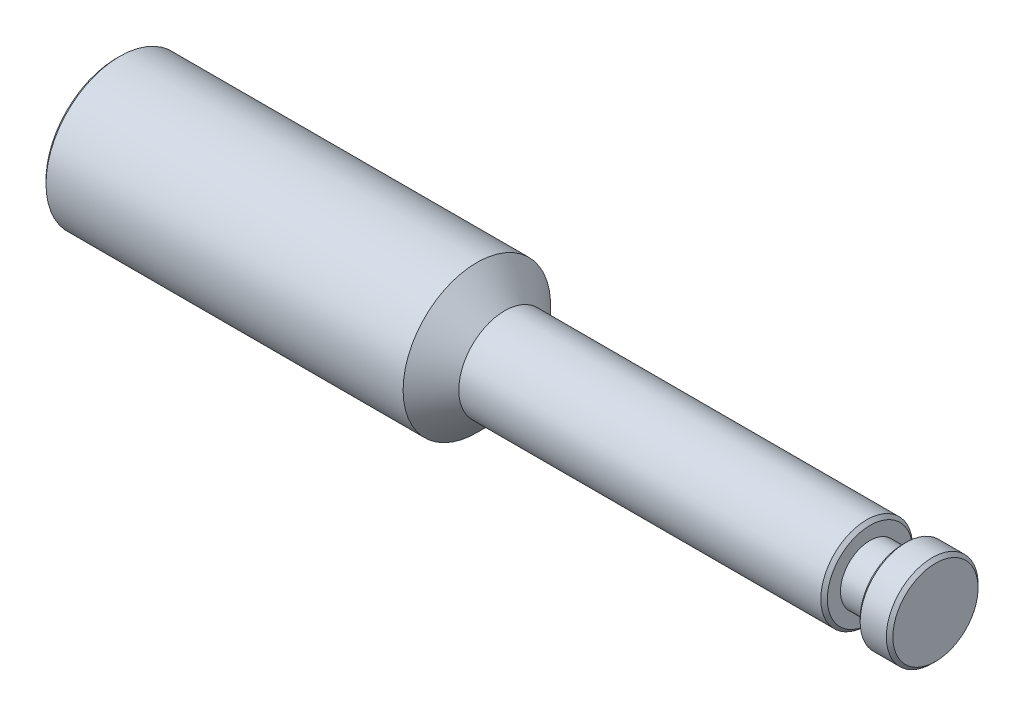
ISO-10303-21;
HEADER;
FILE_DESCRIPTION(('STEP AP214'),'2;1');
FILE_NAME('part.step','',(''),(''),'','','');
FILE_SCHEMA(('AUTOMOTIVE_DESIGN { 1 0 10303 214 1 1 1 1 }'));
ENDSEC;
DATA;
#1=APPLICATION_CONTEXT('core data for automotive mechanical design processes');
#2=APPLICATION_PROTOCOL_DEFINITION('international standard','automotive_design',2000,#1);
#3=PRODUCT_CONTEXT('',#1,'mechanical');
#4=PRODUCT('Part','Part','',(#3));
#5=PRODUCT_RELATED_PRODUCT_CATEGORY('part','',(#4));
#6=PRODUCT_DEFINITION_FORMATION('','',#4);
#7=PRODUCT_DEFINITION_CONTEXT('part definition',#1,'design');
#8=PRODUCT_DEFINITION('design','',#6,#7);
#9=PRODUCT_DEFINITION_SHAPE('','',#8);
#10=(LENGTH_UNIT() NAMED_UNIT(*) SI_UNIT(.MILLI.,.METRE.));
#11=(NAMED_UNIT(*) PLANE_ANGLE_UNIT() SI_UNIT($,.RADIAN.));
#12=(NAMED_UNIT(*) SI_UNIT($,.STERADIAN.) SOLID_ANGLE_UNIT());
#13=UNCERTAINTY_MEASURE_WITH_UNIT(LENGTH_MEASURE(1.E-05),#10,'distance_accuracy_value','');
#14=(GEOMETRIC_REPRESENTATION_CONTEXT(3) GLOBAL_UNCERTAINTY_ASSIGNED_CONTEXT((#13)) GLOBAL_UNIT_ASSIGNED_CONTEXT((#10,
#11,#12)) REPRESENTATION_CONTEXT('',''));
#15=CARTESIAN_POINT('',(0.,0.,0.));
#16=DIRECTION('',(0.,0.,1.));
#17=DIRECTION('',(1.,0.,0.));
#18=AXIS2_PLACEMENT_3D('',#15,#16,#17);
#19=CARTESIAN_POINT('',(0.,0.,0.));
#20=DIRECTION('',(-1.,0.,0.));
#21=DIRECTION('',(0.,0.,1.));
#22=AXIS2_PLACEMENT_3D('',#19,#20,#21);
#23=CYLINDRICAL_SURFACE('',#22,14.);
#24=CARTESIAN_POINT('',(229.,0.,0.));
#25=DIRECTION('',(1.,0.,0.));
#26=DIRECTION('',(0.,0.,-1.));
#27=AXIS2_PLACEMENT_3D('',#24,#25,#26);
#28=CIRCLE('',#27,14.);
#29=CARTESIAN_POINT('',(229.,0.,-14.));
#30=VERTEX_POINT('',#29);
#31=EDGE_CURVE('E52',#30,#30,#28,.F.);
#32=ORIENTED_EDGE('',*,*,#31,.T.);
#33=EDGE_LOOP('',(#32));
#34=FACE_BOUND('',#33,.T.);
#35=CARTESIAN_POINT('',(118.5,0.,0.));
#36=DIRECTION('',(-1.,0.,0.));
#37=DIRECTION('',(0.,0.,1.));
#38=AXIS2_PLACEMENT_3D('',#35,#36,#37);
#39=CIRCLE('',#38,14.);
#40=CARTESIAN_POINT('',(118.5,0.,14.));
#41=VERTEX_POINT('',#40);
#42=EDGE_CURVE('E72',#41,#41,#39,.T.);
#43=ORIENTED_EDGE('',*,*,#42,.F.);
#44=EDGE_LOOP('',(#43));
#45=FACE_BOUND('',#44,.T.);
#46=ADVANCED_FACE('F36',(#34,#45),#23,.T.);
#47=CARTESIAN_POINT('',(0.,0.,0.));
#48=DIRECTION('',(1.,0.,0.));
#49=DIRECTION('',(0.,0.,-1.));
#50=AXIS2_PLACEMENT_3D('',#47,#48,#49);
#51=PLANE('',#50);
#52=CARTESIAN_POINT('',(0.,0.,0.));
#53=DIRECTION('',(1.,0.,0.));
#54=DIRECTION('',(0.,0.,-1.));
#55=AXIS2_PLACEMENT_3D('',#52,#53,#54);
#56=CIRCLE('',#55,21.5);
#57=CARTESIAN_POINT('',(0.,0.,-21.5));
#58=VERTEX_POINT('',#57);
#59=EDGE_CURVE('E44',#58,#58,#56,.F.);
#60=ORIENTED_EDGE('',*,*,#59,.T.);
#61=EDGE_LOOP('',(#60));
#62=FACE_BOUND('',#61,.T.);
#63=ADVANCED_FACE('F100',(#62),#51,.F.);
#64=CARTESIAN_POINT('',(0.,0.,0.));
#65=DIRECTION('',(-1.,0.,0.));
#66=DIRECTION('',(0.,0.,1.));
#67=AXIS2_PLACEMENT_3D('',#64,#65,#66);
#68=CYLINDRICAL_SURFACE('',#67,22.5);
#69=CARTESIAN_POINT('',(1.00000000000001,0.,0.));
#70=DIRECTION('',(1.,0.,0.));
#71=DIRECTION('',(0.,0.,-1.));
#72=AXIS2_PLACEMENT_3D('',#69,#70,#71);
#73=CIRCLE('',#72,22.5);
#74=CARTESIAN_POINT('',(1.00000000000001,0.,-22.5));
#75=VERTEX_POINT('',#74);
#76=EDGE_CURVE('E10',#75,#75,#73,.T.);
#77=ORIENTED_EDGE('',*,*,#76,.T.);
#78=EDGE_LOOP('',(#77));
#79=FACE_BOUND('',#78,.T.);
#80=CARTESIAN_POINT('',(110.,0.,0.));
#81=DIRECTION('',(-1.,0.,0.));
#82=DIRECTION('',(0.,0.,1.));
#83=AXIS2_PLACEMENT_3D('',#80,#81,#82);
#84=CIRCLE('',#83,22.5);
#85=CARTESIAN_POINT('',(110.,0.,22.5));
#86=VERTEX_POINT('',#85);
#87=EDGE_CURVE('E69',#86,#86,#84,.T.);
#88=ORIENTED_EDGE('',*,*,#87,.T.);
#89=EDGE_LOOP('',(#88));
#90=FACE_BOUND('',#89,.T.);
#91=ADVANCED_FACE('F106',(#79,#90),#68,.T.);
#92=CARTESIAN_POINT('',(118.5,0.,0.));
#93=DIRECTION('',(-1.,0.,0.));
#94=DIRECTION('',(0.,0.,1.));
#95=AXIS2_PLACEMENT_3D('',#92,#93,#94);
#96=CONICAL_SURFACE('',#95,14.,0.78539816339745);
#97=ORIENTED_EDGE('',*,*,#87,.F.);
#98=EDGE_LOOP('',(#97));
#99=FACE_BOUND('',#98,.T.);
#100=ORIENTED_EDGE('',*,*,#42,.T.);
#101=EDGE_LOOP('',(#100));
#102=FACE_BOUND('',#101,.T.);
#103=ADVANCED_FACE('F145',(#99,#102),#96,.T.);
#104=CARTESIAN_POINT('',(230.,14.,0.));
#105=DIRECTION('',(1.,0.,0.));
#106=DIRECTION('',(0.,1.,0.));
#107=AXIS2_PLACEMENT_3D('',#104,#105,#106);
#108=PLANE('',#107);
#109=CARTESIAN_POINT('',(230.,0.,0.));
#110=DIRECTION('',(1.,0.,0.));
#111=DIRECTION('',(0.,1.,0.));
#112=AXIS2_PLACEMENT_3D('',#109,#110,#111);
#113=CIRCLE('',#112,12.9999999999999);
#114=CARTESIAN_POINT('',(230.,12.9999999999999,0.));
#115=VERTEX_POINT('',#114);
#116=EDGE_CURVE('E48',#115,#115,#113,.T.);
#117=ORIENTED_EDGE('',*,*,#116,.T.);
#118=EDGE_LOOP('',(#117));
#119=FACE_BOUND('',#118,.T.);
#120=CARTESIAN_POINT('',(230.,0.,0.));
#121=DIRECTION('',(-1.,0.,0.));
#122=DIRECTION('',(0.,-1.,0.));
#123=AXIS2_PLACEMENT_3D('',#120,#121,#122);
#124=CIRCLE('',#123,9.);
#125=CARTESIAN_POINT('',(230.,-9.00000000000001,0.));
#126=VERTEX_POINT('',#125);
#127=EDGE_CURVE('E75',#126,#126,#124,.T.);
#128=ORIENTED_EDGE('',*,*,#127,.T.);
#129=EDGE_LOOP('',(#128));
#130=FACE_BOUND('',#129,.T.);
#131=ADVANCED_FACE('F97',(#119,#130),#108,.T.);
#132=CARTESIAN_POINT('',(0.,0.,0.));
#133=DIRECTION('',(-1.,0.,0.));
#134=DIRECTION('',(0.,-1.,0.));
#135=AXIS2_PLACEMENT_3D('',#132,#133,#134);
#136=CYLINDRICAL_SURFACE('',#135,9.);
#137=CARTESIAN_POINT('',(240.,0.,0.));
#138=DIRECTION('',(-1.,0.,0.));
#139=DIRECTION('',(0.,-1.,0.));
#140=AXIS2_PLACEMENT_3D('',#137,#138,#139);
#141=CIRCLE('',#140,9.);
#142=CARTESIAN_POINT('',(240.,-9.00000000000001,0.));
#143=VERTEX_POINT('',#142);
#144=EDGE_CURVE('E78',#143,#143,#141,.T.);
#145=ORIENTED_EDGE('',*,*,#144,.T.);
#146=EDGE_LOOP('',(#145));
#147=FACE_BOUND('',#146,.T.);
#148=ORIENTED_EDGE('',*,*,#127,.F.);
#149=EDGE_LOOP('',(#148));
#150=FACE_BOUND('',#149,.T.);
#151=ADVANCED_FACE('F82',(#147,#150),#136,.T.);
#152=CARTESIAN_POINT('',(240.,14.,0.));
#153=DIRECTION('',(-1.,0.,0.));
#154=DIRECTION('',(0.,-1.,0.));
#155=AXIS2_PLACEMENT_3D('',#152,#153,#154);
#156=PLANE('',#155);
#157=CARTESIAN_POINT('',(240.,0.,0.));
#158=DIRECTION('',(-1.,0.,0.));
#159=DIRECTION('',(0.,-1.,0.));
#160=AXIS2_PLACEMENT_3D('',#157,#158,#159);
#161=CIRCLE('',#160,13.);
#162=CARTESIAN_POINT('',(240.,-13.,0.));
#163=VERTEX_POINT('',#162);
#164=EDGE_CURVE('E57',#163,#163,#161,.T.);
#165=ORIENTED_EDGE('',*,*,#164,.T.);
#166=EDGE_LOOP('',(#165));
#167=FACE_BOUND('',#166,.T.);
#168=ORIENTED_EDGE('',*,*,#144,.F.);
#169=EDGE_LOOP('',(#168));
#170=FACE_BOUND('',#169,.T.);
#171=ADVANCED_FACE('F85',(#167,#170),#156,.T.);
#172=CARTESIAN_POINT('',(250.,14.,0.));
#173=DIRECTION('',(-1.,0.,0.));
#174=DIRECTION('',(0.,0.,1.));
#175=AXIS2_PLACEMENT_3D('',#172,#173,#174);
#176=PLANE('',#175);
#177=CARTESIAN_POINT('',(250.,0.,0.));
#178=DIRECTION('',(-1.,0.,0.));
#179=DIRECTION('',(0.,0.,1.));
#180=AXIS2_PLACEMENT_3D('',#177,#178,#179);
#181=CIRCLE('',#180,13.);
#182=CARTESIAN_POINT('',(250.,0.,13.));
#183=VERTEX_POINT('',#182);
#184=EDGE_CURVE('E60',#183,#183,#181,.F.);
#185=ORIENTED_EDGE('',*,*,#184,.T.);
#186=EDGE_LOOP('',(#185));
#187=FACE_BOUND('',#186,.T.);
#188=ADVANCED_FACE('F87',(#187),#176,.F.);
#189=CARTESIAN_POINT('',(249.,0.,0.));
#190=DIRECTION('',(-1.,0.,0.));
#191=DIRECTION('',(0.,0.,1.));
#192=AXIS2_PLACEMENT_3D('',#189,#190,#191);
#193=CIRCLE('',#192,14.);
#194=CARTESIAN_POINT('',(249.,0.,14.));
#195=VERTEX_POINT('',#194);
#196=EDGE_CURVE('E63',#195,#195,#193,.T.);
#197=ORIENTED_EDGE('',*,*,#196,.T.);
#198=EDGE_LOOP('',(#197));
#199=FACE_BOUND('',#198,.T.);
#200=CARTESIAN_POINT('',(241.,0.,0.));
#201=DIRECTION('',(-1.,0.,0.));
#202=DIRECTION('',(0.,0.,1.));
#203=AXIS2_PLACEMENT_3D('',#200,#201,#202);
#204=CIRCLE('',#203,14.);
#205=CARTESIAN_POINT('',(241.,0.,14.));
#206=VERTEX_POINT('',#205);
#207=EDGE_CURVE('E66',#206,#206,#204,.F.);
#208=ORIENTED_EDGE('',*,*,#207,.T.);
#209=EDGE_LOOP('',(#208));
#210=FACE_BOUND('',#209,.T.);
#211=ADVANCED_FACE('F94',(#199,#210),#23,.T.);
#212=CARTESIAN_POINT('',(249.,0.,0.));
#213=DIRECTION('',(-1.,0.,0.));
#214=DIRECTION('',(0.,0.,1.));
#215=AXIS2_PLACEMENT_3D('',#212,#213,#214);
#216=CONICAL_SURFACE('',#215,14.,0.785398163397441);
#217=ORIENTED_EDGE('',*,*,#184,.F.);
#218=EDGE_LOOP('',(#217));
#219=FACE_BOUND('',#218,.T.);
#220=ORIENTED_EDGE('',*,*,#196,.F.);
#221=EDGE_LOOP('',(#220));
#222=FACE_BOUND('',#221,.T.);
#223=ADVANCED_FACE('F111',(#219,#222),#216,.T.);
#224=CARTESIAN_POINT('',(240.,0.,0.));
#225=DIRECTION('',(1.,0.,0.));
#226=DIRECTION('',(0.,0.,-1.));
#227=AXIS2_PLACEMENT_3D('',#224,#225,#226);
#228=CONICAL_SURFACE('',#227,13.,0.785398163397455);
#229=ORIENTED_EDGE('',*,*,#207,.F.);
#230=EDGE_LOOP('',(#229));
#231=FACE_BOUND('',#230,.T.);
#232=ORIENTED_EDGE('',*,*,#164,.F.);
#233=EDGE_LOOP('',(#232));
#234=FACE_BOUND('',#233,.T.);
#235=ADVANCED_FACE('F116',(#231,#234),#228,.T.);
#236=CARTESIAN_POINT('',(229.,0.,0.));
#237=DIRECTION('',(-1.,0.,0.));
#238=DIRECTION('',(0.,0.,1.));
#239=AXIS2_PLACEMENT_3D('',#236,#237,#238);
#240=CONICAL_SURFACE('',#239,14.,0.785398163397455);
#241=ORIENTED_EDGE('',*,*,#116,.F.);
#242=EDGE_LOOP('',(#241));
#243=FACE_BOUND('',#242,.T.);
#244=ORIENTED_EDGE('',*,*,#31,.F.);
#245=EDGE_LOOP('',(#244));
#246=FACE_BOUND('',#245,.T.);
#247=ADVANCED_FACE('F125',(#243,#246),#240,.T.);
#248=CARTESIAN_POINT('',(0.,0.,0.));
#249=DIRECTION('',(1.,0.,0.));
#250=DIRECTION('',(0.,0.,-1.));
#251=AXIS2_PLACEMENT_3D('',#248,#249,#250);
#252=CONICAL_SURFACE('',#251,21.5,0.785398163397447);
#253=ORIENTED_EDGE('',*,*,#76,.F.);
#254=EDGE_LOOP('',(#253));
#255=FACE_BOUND('',#254,.T.);
#256=ORIENTED_EDGE('',*,*,#59,.F.);
#257=EDGE_LOOP('',(#256));
#258=FACE_BOUND('',#257,.T.);
#259=ADVANCED_FACE('F39',(#255,#258),#252,.T.);
#260=CLOSED_SHELL('',(#46,#63,#91,#103,#131,#151,#171,#188,#211,#223,#235,#247,#259));
#261=MANIFOLD_SOLID_BREP('B2',#260);
#262=ADVANCED_BREP_SHAPE_REPRESENTATION('',(#18,#261),#14);
#263=SHAPE_DEFINITION_REPRESENTATION(#9,#262);
ENDSEC;
END-ISO-10303-21;
